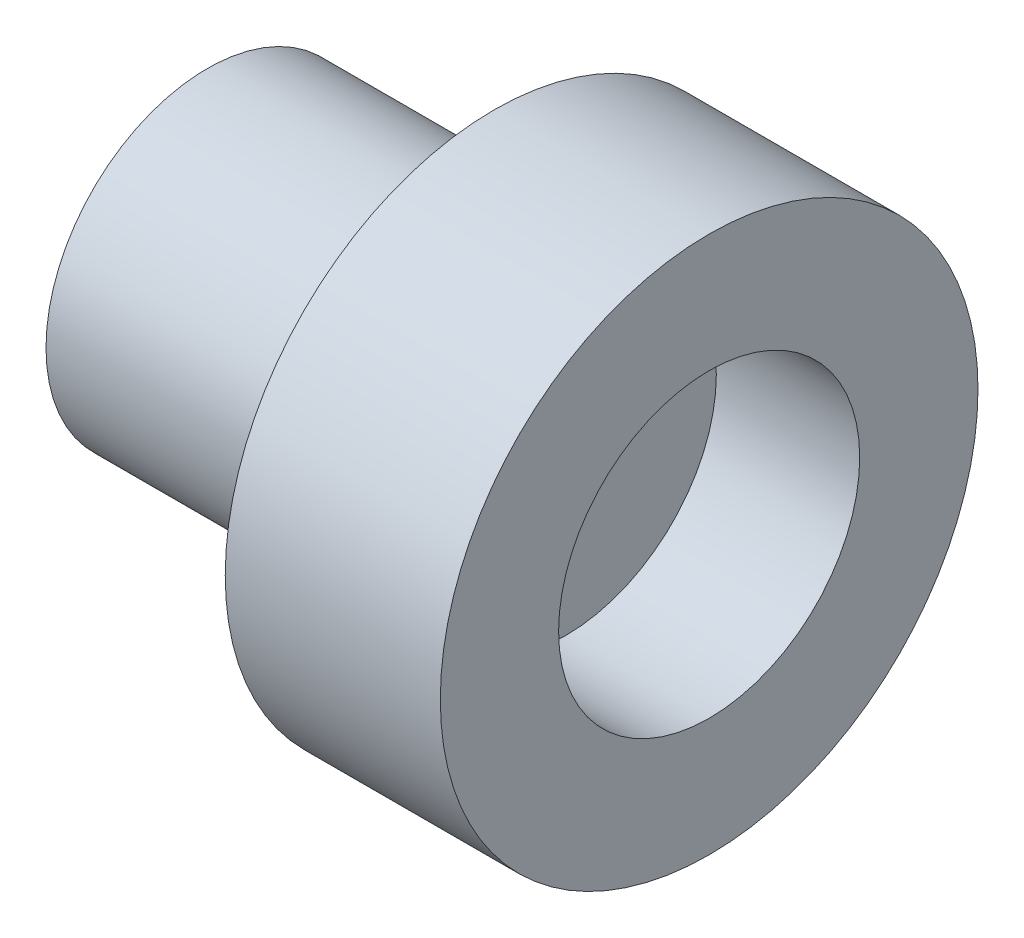
ISO-10303-21;
HEADER;
FILE_DESCRIPTION(('STEP AP214'),'2;1');
FILE_NAME('part.step','',(''),(''),'','','');
FILE_SCHEMA(('AUTOMOTIVE_DESIGN { 1 0 10303 214 1 1 1 1 }'));
ENDSEC;
DATA;
#1=APPLICATION_CONTEXT('core data for automotive mechanical design processes');
#2=APPLICATION_PROTOCOL_DEFINITION('international standard','automotive_design',2000,#1);
#3=PRODUCT_CONTEXT('',#1,'mechanical');
#4=PRODUCT('Part','Part','',(#3));
#5=PRODUCT_RELATED_PRODUCT_CATEGORY('part','',(#4));
#6=PRODUCT_DEFINITION_FORMATION('','',#4);
#7=PRODUCT_DEFINITION_CONTEXT('part definition',#1,'design');
#8=PRODUCT_DEFINITION('design','',#6,#7);
#9=PRODUCT_DEFINITION_SHAPE('','',#8);
#10=(LENGTH_UNIT() NAMED_UNIT(*) SI_UNIT(.MILLI.,.METRE.));
#11=(NAMED_UNIT(*) PLANE_ANGLE_UNIT() SI_UNIT($,.RADIAN.));
#12=(NAMED_UNIT(*) SI_UNIT($,.STERADIAN.) SOLID_ANGLE_UNIT());
#13=UNCERTAINTY_MEASURE_WITH_UNIT(LENGTH_MEASURE(1.E-05),#10,'distance_accuracy_value','');
#14=(GEOMETRIC_REPRESENTATION_CONTEXT(3) GLOBAL_UNCERTAINTY_ASSIGNED_CONTEXT((#13)) GLOBAL_UNIT_ASSIGNED_CONTEXT((#10,
#11,#12)) REPRESENTATION_CONTEXT('',''));
#15=CARTESIAN_POINT('',(0.,0.,0.));
#16=DIRECTION('',(0.,0.,1.));
#17=DIRECTION('',(1.,0.,0.));
#18=AXIS2_PLACEMENT_3D('',#15,#16,#17);
#19=CARTESIAN_POINT('',(0.,2.25,0.));
#20=DIRECTION('',(1.,0.,0.));
#21=DIRECTION('',(0.,0.,-1.));
#22=AXIS2_PLACEMENT_3D('',#19,#20,#21);
#23=PLANE('',#22);
#24=CARTESIAN_POINT('',(0.,0.,0.));
#25=DIRECTION('',(-1.,0.,0.));
#26=DIRECTION('',(0.,0.,1.));
#27=AXIS2_PLACEMENT_3D('',#24,#25,#26);
#28=CIRCLE('',#27,1.1);
#29=CARTESIAN_POINT('',(0.,0.,1.1));
#30=VERTEX_POINT('',#29);
#31=EDGE_CURVE('E45',#30,#30,#28,.T.);
#32=ORIENTED_EDGE('',*,*,#31,.F.);
#33=EDGE_LOOP('',(#32));
#34=FACE_BOUND('',#33,.T.);
#35=CARTESIAN_POINT('',(0.,0.,0.));
#36=DIRECTION('',(-1.,0.,0.));
#37=DIRECTION('',(0.,0.,1.));
#38=AXIS2_PLACEMENT_3D('',#35,#36,#37);
#39=CIRCLE('',#38,2.25);
#40=CARTESIAN_POINT('',(0.,0.,2.25));
#41=VERTEX_POINT('',#40);
#42=EDGE_CURVE('E66',#41,#41,#39,.T.);
#43=ORIENTED_EDGE('',*,*,#42,.T.);
#44=EDGE_LOOP('',(#43));
#45=FACE_BOUND('',#44,.T.);
#46=ADVANCED_FACE('F34',(#34,#45),#23,.F.);
#47=CARTESIAN_POINT('',(0.,0.,0.));
#48=DIRECTION('',(-1.,0.,0.));
#49=DIRECTION('',(0.,0.,1.));
#50=AXIS2_PLACEMENT_3D('',#47,#48,#49);
#51=CYLINDRICAL_SURFACE('',#50,1.1);
#52=CARTESIAN_POINT('',(3.,0.,0.));
#53=DIRECTION('',(-1.,0.,0.));
#54=DIRECTION('',(0.,0.,1.));
#55=AXIS2_PLACEMENT_3D('',#52,#53,#54);
#56=CIRCLE('',#55,1.1);
#57=CARTESIAN_POINT('',(3.,0.,1.1));
#58=VERTEX_POINT('',#57);
#59=EDGE_CURVE('E49',#58,#58,#56,.T.);
#60=ORIENTED_EDGE('',*,*,#59,.F.);
#61=EDGE_LOOP('',(#60));
#62=FACE_BOUND('',#61,.T.);
#63=ORIENTED_EDGE('',*,*,#31,.T.);
#64=EDGE_LOOP('',(#63));
#65=FACE_BOUND('',#64,.T.);
#66=ADVANCED_FACE('F83',(#62,#65),#51,.F.);
#67=CARTESIAN_POINT('',(3.,0.,0.));
#68=DIRECTION('',(1.,0.,0.));
#69=DIRECTION('',(0.,0.,-1.));
#70=AXIS2_PLACEMENT_3D('',#67,#68,#69);
#71=PLANE('',#70);
#72=ORIENTED_EDGE('',*,*,#59,.T.);
#73=EDGE_LOOP('',(#72));
#74=FACE_BOUND('',#73,.T.);
#75=ADVANCED_FACE('F88',(#74),#71,.F.);
#76=CARTESIAN_POINT('',(5.,2.1,0.));
#77=DIRECTION('',(-1.,0.,0.));
#78=DIRECTION('',(0.,0.,1.));
#79=AXIS2_PLACEMENT_3D('',#76,#77,#78);
#80=PLANE('',#79);
#81=CARTESIAN_POINT('',(5.,0.,0.));
#82=DIRECTION('',(-1.,0.,0.));
#83=DIRECTION('',(0.,0.,1.));
#84=AXIS2_PLACEMENT_3D('',#81,#82,#83);
#85=CIRCLE('',#84,2.1);
#86=CARTESIAN_POINT('',(5.,0.,2.1));
#87=VERTEX_POINT('',#86);
#88=EDGE_CURVE('E54',#87,#87,#85,.T.);
#89=ORIENTED_EDGE('',*,*,#88,.F.);
#90=EDGE_LOOP('',(#89));
#91=FACE_BOUND('',#90,.T.);
#92=ADVANCED_FACE('F95',(#91),#80,.F.);
#93=CARTESIAN_POINT('',(0.,0.,0.));
#94=DIRECTION('',(-1.,0.,0.));
#95=DIRECTION('',(0.,0.,1.));
#96=AXIS2_PLACEMENT_3D('',#93,#94,#95);
#97=CYLINDRICAL_SURFACE('',#96,2.1);
#98=CARTESIAN_POINT('',(7.,0.,0.));
#99=DIRECTION('',(-1.,0.,0.));
#100=DIRECTION('',(0.,0.,1.));
#101=AXIS2_PLACEMENT_3D('',#98,#99,#100);
#102=CIRCLE('',#101,2.1);
#103=CARTESIAN_POINT('',(7.,0.,2.1));
#104=VERTEX_POINT('',#103);
#105=EDGE_CURVE('E57',#104,#104,#102,.T.);
#106=ORIENTED_EDGE('',*,*,#105,.F.);
#107=EDGE_LOOP('',(#106));
#108=FACE_BOUND('',#107,.T.);
#109=ORIENTED_EDGE('',*,*,#88,.T.);
#110=EDGE_LOOP('',(#109));
#111=FACE_BOUND('',#110,.T.);
#112=ADVANCED_FACE('F99',(#108,#111),#97,.F.);
#113=CARTESIAN_POINT('',(7.,2.1,0.));
#114=DIRECTION('',(-1.,0.,0.));
#115=DIRECTION('',(0.,0.,1.));
#116=AXIS2_PLACEMENT_3D('',#113,#114,#115);
#117=PLANE('',#116);
#118=CARTESIAN_POINT('',(7.,0.,0.));
#119=DIRECTION('',(-1.,0.,0.));
#120=DIRECTION('',(0.,0.,1.));
#121=AXIS2_PLACEMENT_3D('',#118,#119,#120);
#122=CIRCLE('',#121,3.75);
#123=CARTESIAN_POINT('',(7.,0.,3.75));
#124=VERTEX_POINT('',#123);
#125=EDGE_CURVE('E60',#124,#124,#122,.T.);
#126=ORIENTED_EDGE('',*,*,#125,.F.);
#127=EDGE_LOOP('',(#126));
#128=FACE_BOUND('',#127,.T.);
#129=ORIENTED_EDGE('',*,*,#105,.T.);
#130=EDGE_LOOP('',(#129));
#131=FACE_BOUND('',#130,.T.);
#132=ADVANCED_FACE('F103',(#128,#131),#117,.F.);
#133=CARTESIAN_POINT('',(0.,0.,0.));
#134=DIRECTION('',(-1.,0.,0.));
#135=DIRECTION('',(0.,0.,1.));
#136=AXIS2_PLACEMENT_3D('',#133,#134,#135);
#137=CYLINDRICAL_SURFACE('',#136,3.75);
#138=CARTESIAN_POINT('',(4.,0.,0.));
#139=DIRECTION('',(-1.,0.,0.));
#140=DIRECTION('',(0.,0.,1.));
#141=AXIS2_PLACEMENT_3D('',#138,#139,#140);
#142=CIRCLE('',#141,3.75);
#143=CARTESIAN_POINT('',(4.,0.,3.75));
#144=VERTEX_POINT('',#143);
#145=EDGE_CURVE('E63',#144,#144,#142,.T.);
#146=ORIENTED_EDGE('',*,*,#145,.F.);
#147=EDGE_LOOP('',(#146));
#148=FACE_BOUND('',#147,.T.);
#149=ORIENTED_EDGE('',*,*,#125,.T.);
#150=EDGE_LOOP('',(#149));
#151=FACE_BOUND('',#150,.T.);
#152=ADVANCED_FACE('F80',(#148,#151),#137,.T.);
#153=CARTESIAN_POINT('',(4.,3.75,0.));
#154=DIRECTION('',(1.,0.,0.));
#155=DIRECTION('',(0.,0.,-1.));
#156=AXIS2_PLACEMENT_3D('',#153,#154,#155);
#157=PLANE('',#156);
#158=CARTESIAN_POINT('',(4.,0.,0.));
#159=DIRECTION('',(1.,0.,0.));
#160=DIRECTION('',(0.,0.,-1.));
#161=AXIS2_PLACEMENT_3D('',#158,#159,#160);
#162=CIRCLE('',#161,3.25);
#163=CARTESIAN_POINT('',(4.,0.,-3.25));
#164=VERTEX_POINT('',#163);
#165=EDGE_CURVE('E10',#164,#164,#162,.T.);
#166=ORIENTED_EDGE('',*,*,#165,.T.);
#167=EDGE_LOOP('',(#166));
#168=FACE_BOUND('',#167,.T.);
#169=ORIENTED_EDGE('',*,*,#145,.T.);
#170=EDGE_LOOP('',(#169));
#171=FACE_BOUND('',#170,.T.);
#172=ADVANCED_FACE('F73',(#168,#171),#157,.F.);
#173=CARTESIAN_POINT('',(0.,0.,0.));
#174=DIRECTION('',(-1.,0.,0.));
#175=DIRECTION('',(0.,0.,1.));
#176=AXIS2_PLACEMENT_3D('',#173,#174,#175);
#177=CYLINDRICAL_SURFACE('',#176,2.25);
#178=CARTESIAN_POINT('',(3.,0.,0.));
#179=DIRECTION('',(1.,0.,0.));
#180=DIRECTION('',(0.,0.,-1.));
#181=AXIS2_PLACEMENT_3D('',#178,#179,#180);
#182=CIRCLE('',#181,2.25);
#183=CARTESIAN_POINT('',(3.,0.,-2.25));
#184=VERTEX_POINT('',#183);
#185=EDGE_CURVE('E41',#184,#184,#182,.F.);
#186=ORIENTED_EDGE('',*,*,#185,.T.);
#187=EDGE_LOOP('',(#186));
#188=FACE_BOUND('',#187,.T.);
#189=ORIENTED_EDGE('',*,*,#42,.F.);
#190=EDGE_LOOP('',(#189));
#191=FACE_BOUND('',#190,.T.);
#192=ADVANCED_FACE('F71',(#188,#191),#177,.T.);
#193=CARTESIAN_POINT('',(3.,0.,0.));
#194=DIRECTION('',(1.,0.,0.));
#195=DIRECTION('',(0.,0.,-1.));
#196=AXIS2_PLACEMENT_3D('',#193,#194,#195);
#197=TOROIDAL_SURFACE('',#196,3.25,1.);
#198=ORIENTED_EDGE('',*,*,#165,.F.);
#199=EDGE_LOOP('',(#198));
#200=FACE_BOUND('',#199,.T.);
#201=ORIENTED_EDGE('',*,*,#185,.F.);
#202=EDGE_LOOP('',(#201));
#203=FACE_BOUND('',#202,.T.);
#204=ADVANCED_FACE('F36',(#200,#203),#197,.F.);
#205=CLOSED_SHELL('',(#46,#66,#75,#92,#112,#132,#152,#172,#192,#204));
#206=MANIFOLD_SOLID_BREP('B2',#205);
#207=ADVANCED_BREP_SHAPE_REPRESENTATION('',(#18,#206),#14);
#208=SHAPE_DEFINITION_REPRESENTATION(#9,#207);
ENDSEC;
END-ISO-10303-21;
